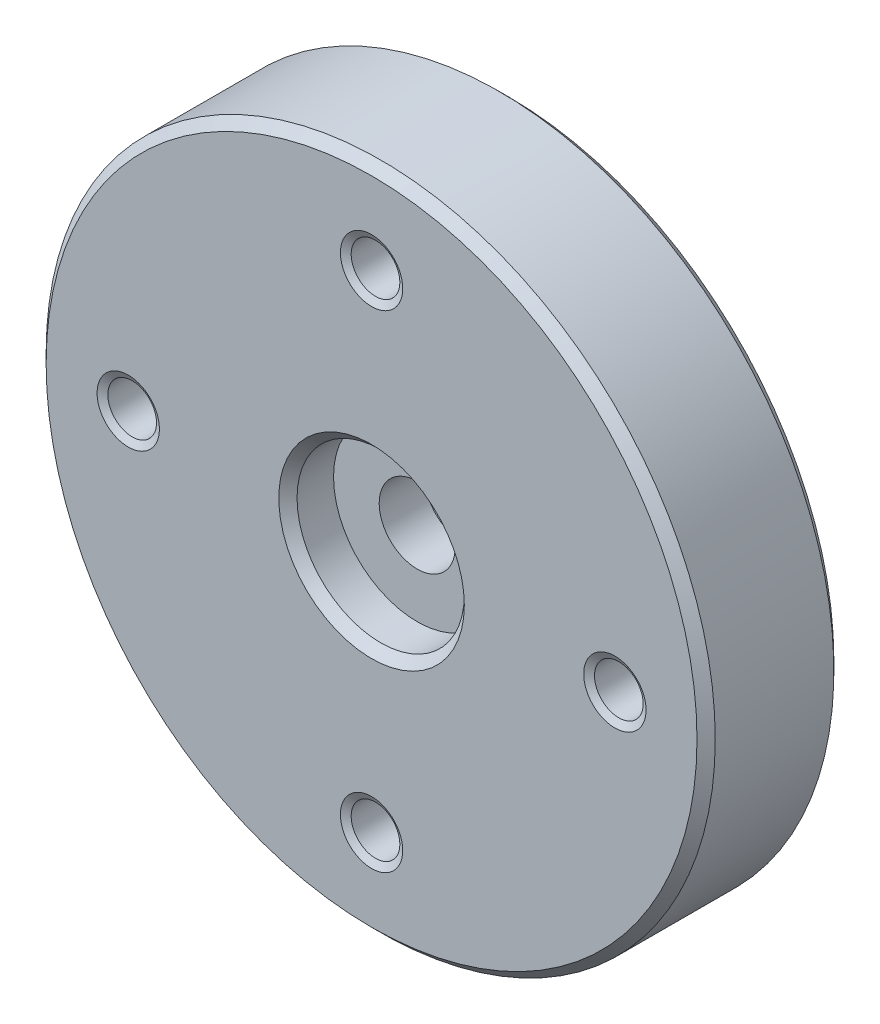
ISO-10303-21;
HEADER;
FILE_DESCRIPTION(('STEP AP214'),'2;1');
FILE_NAME('part.step','',(''),(''),'','','');
FILE_SCHEMA(('AUTOMOTIVE_DESIGN { 1 0 10303 214 1 1 1 1 }'));
ENDSEC;
DATA;
#1=APPLICATION_CONTEXT('core data for automotive mechanical design processes');
#2=APPLICATION_PROTOCOL_DEFINITION('international standard','automotive_design',2000,#1);
#3=PRODUCT_CONTEXT('',#1,'mechanical');
#4=PRODUCT('Part','Part','',(#3));
#5=PRODUCT_RELATED_PRODUCT_CATEGORY('part','',(#4));
#6=PRODUCT_DEFINITION_FORMATION('','',#4);
#7=PRODUCT_DEFINITION_CONTEXT('part definition',#1,'design');
#8=PRODUCT_DEFINITION('design','',#6,#7);
#9=PRODUCT_DEFINITION_SHAPE('','',#8);
#10=(LENGTH_UNIT() NAMED_UNIT(*) SI_UNIT(.MILLI.,.METRE.));
#11=(NAMED_UNIT(*) PLANE_ANGLE_UNIT() SI_UNIT($,.RADIAN.));
#12=(NAMED_UNIT(*) SI_UNIT($,.STERADIAN.) SOLID_ANGLE_UNIT());
#13=UNCERTAINTY_MEASURE_WITH_UNIT(LENGTH_MEASURE(1.E-05),#10,'distance_accuracy_value','');
#14=(GEOMETRIC_REPRESENTATION_CONTEXT(3) GLOBAL_UNCERTAINTY_ASSIGNED_CONTEXT((#13)) GLOBAL_UNIT_ASSIGNED_CONTEXT((#10,
#11,#12)) REPRESENTATION_CONTEXT('',''));
#15=CARTESIAN_POINT('',(0.,0.,0.));
#16=DIRECTION('',(0.,0.,1.));
#17=DIRECTION('',(1.,0.,0.));
#18=AXIS2_PLACEMENT_3D('',#15,#16,#17);
#19=CARTESIAN_POINT('',(0.,0.,0.));
#20=DIRECTION('',(0.,0.,-1.));
#21=DIRECTION('',(-1.,0.,0.));
#22=AXIS2_PLACEMENT_3D('',#19,#20,#21);
#23=CYLINDRICAL_SURFACE('',#22,2.75);
#24=CARTESIAN_POINT('',(0.,0.,-0.300000000000006));
#25=DIRECTION('',(0.,0.,1.));
#26=DIRECTION('',(1.,0.,0.));
#27=AXIS2_PLACEMENT_3D('',#24,#25,#26);
#28=CIRCLE('',#27,2.75);
#29=CARTESIAN_POINT('',(2.75,0.,-0.300000000000006));
#30=VERTEX_POINT('',#29);
#31=EDGE_CURVE('E75',#30,#30,#28,.T.);
#32=ORIENTED_EDGE('',*,*,#31,.T.);
#33=EDGE_LOOP('',(#32));
#34=FACE_BOUND('',#33,.T.);
#35=CARTESIAN_POINT('',(0.,0.,-1.5));
#36=DIRECTION('',(0.,0.,-1.));
#37=DIRECTION('',(-1.,0.,0.));
#38=AXIS2_PLACEMENT_3D('',#35,#36,#37);
#39=CIRCLE('',#38,2.75);
#40=CARTESIAN_POINT('',(-2.75,0.,-1.5));
#41=VERTEX_POINT('',#40);
#42=EDGE_CURVE('E107',#41,#41,#39,.T.);
#43=ORIENTED_EDGE('',*,*,#42,.T.);
#44=EDGE_LOOP('',(#43));
#45=FACE_BOUND('',#44,.T.);
#46=ADVANCED_FACE('F42',(#34,#45),#23,.F.);
#47=CARTESIAN_POINT('',(0.,2.75,0.));
#48=DIRECTION('',(0.,0.,1.));
#49=DIRECTION('',(1.,0.,0.));
#50=AXIS2_PLACEMENT_3D('',#47,#48,#49);
#51=PLANE('',#50);
#52=CARTESIAN_POINT('',(0.,0.,0.));
#53=DIRECTION('',(0.,0.,1.));
#54=DIRECTION('',(1.,0.,0.));
#55=AXIS2_PLACEMENT_3D('',#52,#53,#54);
#56=CIRCLE('',#55,3.05);
#57=CARTESIAN_POINT('',(3.05,0.,0.));
#58=VERTEX_POINT('',#57);
#59=EDGE_CURVE('E79',#58,#58,#56,.F.);
#60=ORIENTED_EDGE('',*,*,#59,.T.);
#61=EDGE_LOOP('',(#60));
#62=FACE_BOUND('',#61,.T.);
#63=CARTESIAN_POINT('',(0.,0.,0.));
#64=DIRECTION('',(0.,0.,1.));
#65=DIRECTION('',(1.,0.,0.));
#66=AXIS2_PLACEMENT_3D('',#63,#64,#65);
#67=CIRCLE('',#66,10.7);
#68=CARTESIAN_POINT('',(10.7,0.,0.));
#69=VERTEX_POINT('',#68);
#70=EDGE_CURVE('E83',#69,#69,#67,.T.);
#71=ORIENTED_EDGE('',*,*,#70,.T.);
#72=EDGE_LOOP('',(#71));
#73=FACE_BOUND('',#72,.T.);
#74=CARTESIAN_POINT('',(0.,8.,0.));
#75=DIRECTION('',(0.,0.,1.));
#76=DIRECTION('',(1.,0.,0.));
#77=AXIS2_PLACEMENT_3D('',#74,#75,#76);
#78=CIRCLE('',#77,1.025);
#79=CARTESIAN_POINT('',(1.025,8.,0.));
#80=VERTEX_POINT('',#79);
#81=EDGE_CURVE('E167',#80,#80,#78,.T.);
#82=ORIENTED_EDGE('',*,*,#81,.F.);
#83=EDGE_LOOP('',(#82));
#84=FACE_BOUND('',#83,.T.);
#85=CARTESIAN_POINT('',(8.,0.,0.));
#86=DIRECTION('',(0.,0.,1.));
#87=DIRECTION('',(1.,0.,0.));
#88=AXIS2_PLACEMENT_3D('',#85,#86,#87);
#89=CIRCLE('',#88,1.025);
#90=CARTESIAN_POINT('',(9.025,0.,0.));
#91=VERTEX_POINT('',#90);
#92=EDGE_CURVE('E151',#91,#91,#89,.T.);
#93=ORIENTED_EDGE('',*,*,#92,.F.);
#94=EDGE_LOOP('',(#93));
#95=FACE_BOUND('',#94,.T.);
#96=CARTESIAN_POINT('',(0.,-8.,0.));
#97=DIRECTION('',(0.,0.,1.));
#98=DIRECTION('',(1.,0.,0.));
#99=AXIS2_PLACEMENT_3D('',#96,#97,#98);
#100=CIRCLE('',#99,1.025);
#101=CARTESIAN_POINT('',(1.025,-8.,0.));
#102=VERTEX_POINT('',#101);
#103=EDGE_CURVE('E135',#102,#102,#100,.T.);
#104=ORIENTED_EDGE('',*,*,#103,.F.);
#105=EDGE_LOOP('',(#104));
#106=FACE_BOUND('',#105,.T.);
#107=CARTESIAN_POINT('',(-8.,0.,0.));
#108=DIRECTION('',(0.,0.,1.));
#109=DIRECTION('',(1.,0.,0.));
#110=AXIS2_PLACEMENT_3D('',#107,#108,#109);
#111=CIRCLE('',#110,1.025);
#112=CARTESIAN_POINT('',(-6.975,0.,0.));
#113=VERTEX_POINT('',#112);
#114=EDGE_CURVE('E119',#113,#113,#111,.T.);
#115=ORIENTED_EDGE('',*,*,#114,.F.);
#116=EDGE_LOOP('',(#115));
#117=FACE_BOUND('',#116,.T.);
#118=ADVANCED_FACE('F201',(#62,#73,#84,#95,#106,#117),#51,.T.);
#119=CARTESIAN_POINT('',(0.,0.,0.));
#120=DIRECTION('',(0.,0.,-1.));
#121=DIRECTION('',(-1.,0.,0.));
#122=AXIS2_PLACEMENT_3D('',#119,#120,#121);
#123=CYLINDRICAL_SURFACE('',#122,11.);
#124=CARTESIAN_POINT('',(0.,0.,-4.2));
#125=DIRECTION('',(0.,0.,-1.));
#126=DIRECTION('',(-1.,0.,0.));
#127=AXIS2_PLACEMENT_3D('',#124,#125,#126);
#128=CIRCLE('',#127,11.);
#129=CARTESIAN_POINT('',(-11.,0.,-4.2));
#130=VERTEX_POINT('',#129);
#131=EDGE_CURVE('E10',#130,#130,#128,.F.);
#132=ORIENTED_EDGE('',*,*,#131,.T.);
#133=EDGE_LOOP('',(#132));
#134=FACE_BOUND('',#133,.T.);
#135=CARTESIAN_POINT('',(0.,0.,-0.299999999999998));
#136=DIRECTION('',(0.,0.,1.));
#137=DIRECTION('',(1.,0.,0.));
#138=AXIS2_PLACEMENT_3D('',#135,#136,#137);
#139=CIRCLE('',#138,11.);
#140=CARTESIAN_POINT('',(11.,0.,-0.299999999999998));
#141=VERTEX_POINT('',#140);
#142=EDGE_CURVE('E50',#141,#141,#139,.F.);
#143=ORIENTED_EDGE('',*,*,#142,.T.);
#144=EDGE_LOOP('',(#143));
#145=FACE_BOUND('',#144,.T.);
#146=ADVANCED_FACE('F204',(#134,#145),#123,.T.);
#147=CARTESIAN_POINT('',(0.,11.,-4.5));
#148=DIRECTION('',(0.,0.,-1.));
#149=DIRECTION('',(-1.,0.,0.));
#150=AXIS2_PLACEMENT_3D('',#147,#148,#149);
#151=PLANE('',#150);
#152=CARTESIAN_POINT('',(0.,0.,-4.5));
#153=DIRECTION('',(0.,0.,-1.));
#154=DIRECTION('',(-1.,0.,0.));
#155=AXIS2_PLACEMENT_3D('',#152,#153,#154);
#156=CIRCLE('',#155,10.7);
#157=CARTESIAN_POINT('',(-10.7,0.,-4.5));
#158=VERTEX_POINT('',#157);
#159=EDGE_CURVE('E58',#158,#158,#156,.T.);
#160=ORIENTED_EDGE('',*,*,#159,.T.);
#161=EDGE_LOOP('',(#160));
#162=FACE_BOUND('',#161,.T.);
#163=CARTESIAN_POINT('',(0.,8.,-4.5));
#164=DIRECTION('',(0.,0.,1.));
#165=DIRECTION('',(1.,0.,0.));
#166=AXIS2_PLACEMENT_3D('',#163,#164,#165);
#167=CIRCLE('',#166,1.025);
#168=CARTESIAN_POINT('',(1.025,8.,-4.5));
#169=VERTEX_POINT('',#168);
#170=EDGE_CURVE('E171',#169,#169,#167,.T.);
#171=ORIENTED_EDGE('',*,*,#170,.T.);
#172=EDGE_LOOP('',(#171));
#173=FACE_BOUND('',#172,.T.);
#174=CARTESIAN_POINT('',(8.,0.,-4.5));
#175=DIRECTION('',(0.,0.,1.));
#176=DIRECTION('',(1.,0.,0.));
#177=AXIS2_PLACEMENT_3D('',#174,#175,#176);
#178=CIRCLE('',#177,1.025);
#179=CARTESIAN_POINT('',(9.025,0.,-4.5));
#180=VERTEX_POINT('',#179);
#181=EDGE_CURVE('E155',#180,#180,#178,.T.);
#182=ORIENTED_EDGE('',*,*,#181,.T.);
#183=EDGE_LOOP('',(#182));
#184=FACE_BOUND('',#183,.T.);
#185=CARTESIAN_POINT('',(0.,-8.,-4.5));
#186=DIRECTION('',(0.,0.,1.));
#187=DIRECTION('',(1.,0.,0.));
#188=AXIS2_PLACEMENT_3D('',#185,#186,#187);
#189=CIRCLE('',#188,1.025);
#190=CARTESIAN_POINT('',(1.025,-8.,-4.5));
#191=VERTEX_POINT('',#190);
#192=EDGE_CURVE('E139',#191,#191,#189,.T.);
#193=ORIENTED_EDGE('',*,*,#192,.T.);
#194=EDGE_LOOP('',(#193));
#195=FACE_BOUND('',#194,.T.);
#196=CARTESIAN_POINT('',(-8.,0.,-4.5));
#197=DIRECTION('',(0.,0.,1.));
#198=DIRECTION('',(1.,0.,0.));
#199=AXIS2_PLACEMENT_3D('',#196,#197,#198);
#200=CIRCLE('',#199,1.025);
#201=CARTESIAN_POINT('',(-6.975,0.,-4.5));
#202=VERTEX_POINT('',#201);
#203=EDGE_CURVE('E123',#202,#202,#200,.T.);
#204=ORIENTED_EDGE('',*,*,#203,.T.);
#205=EDGE_LOOP('',(#204));
#206=FACE_BOUND('',#205,.T.);
#207=CARTESIAN_POINT('',(0.,0.,-4.5));
#208=DIRECTION('',(0.,0.,-1.));
#209=DIRECTION('',(-1.,0.,0.));
#210=AXIS2_PLACEMENT_3D('',#207,#208,#209);
#211=CIRCLE('',#210,4.5);
#212=CARTESIAN_POINT('',(-4.5,0.,-4.5));
#213=VERTEX_POINT('',#212);
#214=EDGE_CURVE('E87',#213,#213,#211,.T.);
#215=ORIENTED_EDGE('',*,*,#214,.F.);
#216=EDGE_LOOP('',(#215));
#217=FACE_BOUND('',#216,.T.);
#218=ADVANCED_FACE('F178',(#162,#173,#184,#195,#206,#217),#151,.T.);
#219=CARTESIAN_POINT('',(0.,0.,0.));
#220=DIRECTION('',(0.,0.,-1.));
#221=DIRECTION('',(-1.,0.,0.));
#222=AXIS2_PLACEMENT_3D('',#219,#220,#221);
#223=CYLINDRICAL_SURFACE('',#222,4.5);
#224=CARTESIAN_POINT('',(0.,0.,-6.4));
#225=DIRECTION('',(0.,0.,-1.));
#226=DIRECTION('',(-1.,0.,0.));
#227=AXIS2_PLACEMENT_3D('',#224,#225,#226);
#228=CIRCLE('',#227,4.5);
#229=CARTESIAN_POINT('',(-4.5,0.,-6.4));
#230=VERTEX_POINT('',#229);
#231=EDGE_CURVE('E65',#230,#230,#228,.F.);
#232=ORIENTED_EDGE('',*,*,#231,.T.);
#233=EDGE_LOOP('',(#232));
#234=FACE_BOUND('',#233,.T.);
#235=ORIENTED_EDGE('',*,*,#214,.T.);
#236=EDGE_LOOP('',(#235));
#237=FACE_BOUND('',#236,.T.);
#238=ADVANCED_FACE('F254',(#234,#237),#223,.T.);
#239=CARTESIAN_POINT('',(0.,4.5,-6.7));
#240=DIRECTION('',(0.,0.,-1.));
#241=DIRECTION('',(-1.,0.,0.));
#242=AXIS2_PLACEMENT_3D('',#239,#240,#241);
#243=PLANE('',#242);
#244=CARTESIAN_POINT('',(0.,0.,-6.7));
#245=DIRECTION('',(0.,0.,-1.));
#246=DIRECTION('',(-1.,0.,0.));
#247=AXIS2_PLACEMENT_3D('',#244,#245,#246);
#248=CIRCLE('',#247,4.2);
#249=CARTESIAN_POINT('',(-4.2,0.,-6.7));
#250=VERTEX_POINT('',#249);
#251=EDGE_CURVE('E71',#250,#250,#248,.T.);
#252=ORIENTED_EDGE('',*,*,#251,.T.);
#253=EDGE_LOOP('',(#252));
#254=FACE_BOUND('',#253,.T.);
#255=CARTESIAN_POINT('',(0.,0.,-6.7));
#256=DIRECTION('',(0.,0.,-1.));
#257=DIRECTION('',(-1.,0.,0.));
#258=AXIS2_PLACEMENT_3D('',#255,#256,#257);
#259=CIRCLE('',#258,2.75);
#260=CARTESIAN_POINT('',(-2.75,0.,-6.7));
#261=VERTEX_POINT('',#260);
#262=EDGE_CURVE('E91',#261,#261,#259,.T.);
#263=ORIENTED_EDGE('',*,*,#262,.F.);
#264=EDGE_LOOP('',(#263));
#265=FACE_BOUND('',#264,.T.);
#266=ADVANCED_FACE('F260',(#254,#265),#243,.T.);
#267=CARTESIAN_POINT('',(0.,0.,0.));
#268=DIRECTION('',(0.,0.,-1.));
#269=DIRECTION('',(-1.,0.,0.));
#270=AXIS2_PLACEMENT_3D('',#267,#268,#269);
#271=CYLINDRICAL_SURFACE('',#270,2.75);
#272=ORIENTED_EDGE('',*,*,#262,.T.);
#273=EDGE_LOOP('',(#272));
#274=FACE_BOUND('',#273,.T.);
#275=CARTESIAN_POINT('',(0.,0.,-3.));
#276=DIRECTION('',(0.,0.,-1.));
#277=DIRECTION('',(-1.,0.,0.));
#278=AXIS2_PLACEMENT_3D('',#275,#276,#277);
#279=CIRCLE('',#278,2.75);
#280=CARTESIAN_POINT('',(-2.75,0.,-3.));
#281=VERTEX_POINT('',#280);
#282=EDGE_CURVE('E95',#281,#281,#279,.T.);
#283=ORIENTED_EDGE('',*,*,#282,.F.);
#284=EDGE_LOOP('',(#283));
#285=FACE_BOUND('',#284,.T.);
#286=ADVANCED_FACE('F266',(#274,#285),#271,.F.);
#287=CARTESIAN_POINT('',(0.,2.75,-3.));
#288=DIRECTION('',(0.,0.,-1.));
#289=DIRECTION('',(-1.,0.,0.));
#290=AXIS2_PLACEMENT_3D('',#287,#288,#289);
#291=PLANE('',#290);
#292=ORIENTED_EDGE('',*,*,#282,.T.);
#293=EDGE_LOOP('',(#292));
#294=FACE_BOUND('',#293,.T.);
#295=CARTESIAN_POINT('',(0.,0.,-3.));
#296=DIRECTION('',(0.,0.,-1.));
#297=DIRECTION('',(-1.,0.,0.));
#298=AXIS2_PLACEMENT_3D('',#295,#296,#297);
#299=CIRCLE('',#298,1.25);
#300=CARTESIAN_POINT('',(-1.25,0.,-3.));
#301=VERTEX_POINT('',#300);
#302=EDGE_CURVE('E99',#301,#301,#299,.T.);
#303=ORIENTED_EDGE('',*,*,#302,.F.);
#304=EDGE_LOOP('',(#303));
#305=FACE_BOUND('',#304,.T.);
#306=ADVANCED_FACE('F270',(#294,#305),#291,.T.);
#307=CARTESIAN_POINT('',(0.,0.,0.));
#308=DIRECTION('',(0.,0.,-1.));
#309=DIRECTION('',(-1.,0.,0.));
#310=AXIS2_PLACEMENT_3D('',#307,#308,#309);
#311=CYLINDRICAL_SURFACE('',#310,1.25);
#312=ORIENTED_EDGE('',*,*,#302,.T.);
#313=EDGE_LOOP('',(#312));
#314=FACE_BOUND('',#313,.T.);
#315=CARTESIAN_POINT('',(0.,0.,-1.5));
#316=DIRECTION('',(0.,0.,-1.));
#317=DIRECTION('',(-1.,0.,0.));
#318=AXIS2_PLACEMENT_3D('',#315,#316,#317);
#319=CIRCLE('',#318,1.25);
#320=CARTESIAN_POINT('',(-1.25,0.,-1.5));
#321=VERTEX_POINT('',#320);
#322=EDGE_CURVE('E103',#321,#321,#319,.T.);
#323=ORIENTED_EDGE('',*,*,#322,.F.);
#324=EDGE_LOOP('',(#323));
#325=FACE_BOUND('',#324,.T.);
#326=ADVANCED_FACE('F274',(#314,#325),#311,.F.);
#327=CARTESIAN_POINT('',(0.,2.75,-1.5));
#328=DIRECTION('',(0.,0.,1.));
#329=DIRECTION('',(1.,0.,0.));
#330=AXIS2_PLACEMENT_3D('',#327,#328,#329);
#331=PLANE('',#330);
#332=ORIENTED_EDGE('',*,*,#322,.T.);
#333=EDGE_LOOP('',(#332));
#334=FACE_BOUND('',#333,.T.);
#335=ORIENTED_EDGE('',*,*,#42,.F.);
#336=EDGE_LOOP('',(#335));
#337=FACE_BOUND('',#336,.T.);
#338=ADVANCED_FACE('F278',(#334,#337),#331,.T.);
#339=CARTESIAN_POINT('',(-8.,0.,-4.37009618943233));
#340=DIRECTION('',(0.,0.,-1.));
#341=DIRECTION('',(-1.,0.,0.));
#342=AXIS2_PLACEMENT_3D('',#339,#340,#341);
#343=CONICAL_SURFACE('',#342,0.799999999999999,1.0471975511966);
#344=ORIENTED_EDGE('',*,*,#203,.F.);
#345=EDGE_LOOP('',(#344));
#346=FACE_BOUND('',#345,.T.);
#347=CARTESIAN_POINT('',(-8.,0.,-4.37009618943233));
#348=DIRECTION('',(0.,0.,1.));
#349=DIRECTION('',(1.,0.,0.));
#350=AXIS2_PLACEMENT_3D('',#347,#348,#349);
#351=CIRCLE('',#350,0.799999999999999);
#352=CARTESIAN_POINT('',(-7.2,0.,-4.37009618943233));
#353=VERTEX_POINT('',#352);
#354=EDGE_CURVE('E111',#353,#353,#351,.T.);
#355=ORIENTED_EDGE('',*,*,#354,.T.);
#356=EDGE_LOOP('',(#355));
#357=FACE_BOUND('',#356,.T.);
#358=ADVANCED_FACE('F226',(#346,#357),#343,.F.);
#359=CARTESIAN_POINT('',(-8.,0.,0.));
#360=DIRECTION('',(0.,0.,1.));
#361=DIRECTION('',(1.,0.,0.));
#362=AXIS2_PLACEMENT_3D('',#359,#360,#361);
#363=CYLINDRICAL_SURFACE('',#362,0.799999999999999);
#364=ORIENTED_EDGE('',*,*,#354,.F.);
#365=EDGE_LOOP('',(#364));
#366=FACE_BOUND('',#365,.T.);
#367=CARTESIAN_POINT('',(-8.,0.,-0.129903810567662));
#368=DIRECTION('',(0.,0.,1.));
#369=DIRECTION('',(1.,0.,0.));
#370=AXIS2_PLACEMENT_3D('',#367,#368,#369);
#371=CIRCLE('',#370,0.8);
#372=CARTESIAN_POINT('',(-7.2,0.,-0.129903810567662));
#373=VERTEX_POINT('',#372);
#374=EDGE_CURVE('E115',#373,#373,#371,.T.);
#375=ORIENTED_EDGE('',*,*,#374,.T.);
#376=EDGE_LOOP('',(#375));
#377=FACE_BOUND('',#376,.T.);
#378=ADVANCED_FACE('F216',(#366,#377),#363,.F.);
#379=CARTESIAN_POINT('',(-8.,0.,0.));
#380=DIRECTION('',(0.,0.,1.));
#381=DIRECTION('',(1.,0.,0.));
#382=AXIS2_PLACEMENT_3D('',#379,#380,#381);
#383=CONICAL_SURFACE('',#382,1.025,1.0471975511966);
#384=ORIENTED_EDGE('',*,*,#374,.F.);
#385=EDGE_LOOP('',(#384));
#386=FACE_BOUND('',#385,.T.);
#387=ORIENTED_EDGE('',*,*,#114,.T.);
#388=EDGE_LOOP('',(#387));
#389=FACE_BOUND('',#388,.T.);
#390=ADVANCED_FACE('F213',(#386,#389),#383,.F.);
#391=CARTESIAN_POINT('',(0.,-8.,-4.37009618943233));
#392=DIRECTION('',(0.,0.,-1.));
#393=DIRECTION('',(-1.,0.,0.));
#394=AXIS2_PLACEMENT_3D('',#391,#392,#393);
#395=CONICAL_SURFACE('',#394,0.799999999999999,1.0471975511966);
#396=ORIENTED_EDGE('',*,*,#192,.F.);
#397=EDGE_LOOP('',(#396));
#398=FACE_BOUND('',#397,.T.);
#399=CARTESIAN_POINT('',(0.,-8.,-4.37009618943233));
#400=DIRECTION('',(0.,0.,1.));
#401=DIRECTION('',(1.,0.,0.));
#402=AXIS2_PLACEMENT_3D('',#399,#400,#401);
#403=CIRCLE('',#402,0.799999999999999);
#404=CARTESIAN_POINT('',(0.799999999999999,-8.,-4.37009618943233));
#405=VERTEX_POINT('',#404);
#406=EDGE_CURVE('E127',#405,#405,#403,.T.);
#407=ORIENTED_EDGE('',*,*,#406,.T.);
#408=EDGE_LOOP('',(#407));
#409=FACE_BOUND('',#408,.T.);
#410=ADVANCED_FACE('F215',(#398,#409),#395,.F.);
#411=CARTESIAN_POINT('',(0.,-8.,0.));
#412=DIRECTION('',(0.,0.,1.));
#413=DIRECTION('',(1.,0.,0.));
#414=AXIS2_PLACEMENT_3D('',#411,#412,#413);
#415=CYLINDRICAL_SURFACE('',#414,0.799999999999999);
#416=ORIENTED_EDGE('',*,*,#406,.F.);
#417=EDGE_LOOP('',(#416));
#418=FACE_BOUND('',#417,.T.);
#419=CARTESIAN_POINT('',(0.,-8.,-0.129903810567662));
#420=DIRECTION('',(0.,0.,1.));
#421=DIRECTION('',(1.,0.,0.));
#422=AXIS2_PLACEMENT_3D('',#419,#420,#421);
#423=CIRCLE('',#422,0.8);
#424=CARTESIAN_POINT('',(0.8,-8.,-0.129903810567662));
#425=VERTEX_POINT('',#424);
#426=EDGE_CURVE('E131',#425,#425,#423,.T.);
#427=ORIENTED_EDGE('',*,*,#426,.T.);
#428=EDGE_LOOP('',(#427));
#429=FACE_BOUND('',#428,.T.);
#430=ADVANCED_FACE('F223',(#418,#429),#415,.F.);
#431=CARTESIAN_POINT('',(0.,-8.,0.));
#432=DIRECTION('',(0.,0.,1.));
#433=DIRECTION('',(1.,0.,0.));
#434=AXIS2_PLACEMENT_3D('',#431,#432,#433);
#435=CONICAL_SURFACE('',#434,1.025,1.0471975511966);
#436=ORIENTED_EDGE('',*,*,#426,.F.);
#437=EDGE_LOOP('',(#436));
#438=FACE_BOUND('',#437,.T.);
#439=ORIENTED_EDGE('',*,*,#103,.T.);
#440=EDGE_LOOP('',(#439));
#441=FACE_BOUND('',#440,.T.);
#442=ADVANCED_FACE('F317',(#438,#441),#435,.F.);
#443=CARTESIAN_POINT('',(8.,0.,-4.37009618943233));
#444=DIRECTION('',(0.,0.,-1.));
#445=DIRECTION('',(-1.,0.,0.));
#446=AXIS2_PLACEMENT_3D('',#443,#444,#445);
#447=CONICAL_SURFACE('',#446,0.799999999999999,1.04719755119659);
#448=ORIENTED_EDGE('',*,*,#181,.F.);
#449=EDGE_LOOP('',(#448));
#450=FACE_BOUND('',#449,.T.);
#451=CARTESIAN_POINT('',(8.,0.,-4.37009618943233));
#452=DIRECTION('',(0.,0.,1.));
#453=DIRECTION('',(1.,0.,0.));
#454=AXIS2_PLACEMENT_3D('',#451,#452,#453);
#455=CIRCLE('',#454,0.799999999999999);
#456=CARTESIAN_POINT('',(8.8,0.,-4.37009618943233));
#457=VERTEX_POINT('',#456);
#458=EDGE_CURVE('E143',#457,#457,#455,.T.);
#459=ORIENTED_EDGE('',*,*,#458,.T.);
#460=EDGE_LOOP('',(#459));
#461=FACE_BOUND('',#460,.T.);
#462=ADVANCED_FACE('F326',(#450,#461),#447,.F.);
#463=CARTESIAN_POINT('',(8.,0.,0.));
#464=DIRECTION('',(0.,0.,1.));
#465=DIRECTION('',(1.,0.,0.));
#466=AXIS2_PLACEMENT_3D('',#463,#464,#465);
#467=CYLINDRICAL_SURFACE('',#466,0.799999999999999);
#468=ORIENTED_EDGE('',*,*,#458,.F.);
#469=EDGE_LOOP('',(#468));
#470=FACE_BOUND('',#469,.T.);
#471=CARTESIAN_POINT('',(8.,0.,-0.129903810567662));
#472=DIRECTION('',(0.,0.,1.));
#473=DIRECTION('',(1.,0.,0.));
#474=AXIS2_PLACEMENT_3D('',#471,#472,#473);
#475=CIRCLE('',#474,0.8);
#476=CARTESIAN_POINT('',(8.8,0.,-0.129903810567662));
#477=VERTEX_POINT('',#476);
#478=EDGE_CURVE('E147',#477,#477,#475,.T.);
#479=ORIENTED_EDGE('',*,*,#478,.T.);
#480=EDGE_LOOP('',(#479));
#481=FACE_BOUND('',#480,.T.);
#482=ADVANCED_FACE('F335',(#470,#481),#467,.F.);
#483=CARTESIAN_POINT('',(8.,0.,0.));
#484=DIRECTION('',(0.,0.,1.));
#485=DIRECTION('',(1.,0.,0.));
#486=AXIS2_PLACEMENT_3D('',#483,#484,#485);
#487=CONICAL_SURFACE('',#486,1.025,1.0471975511966);
#488=ORIENTED_EDGE('',*,*,#478,.F.);
#489=EDGE_LOOP('',(#488));
#490=FACE_BOUND('',#489,.T.);
#491=ORIENTED_EDGE('',*,*,#92,.T.);
#492=EDGE_LOOP('',(#491));
#493=FACE_BOUND('',#492,.T.);
#494=ADVANCED_FACE('F185',(#490,#493),#487,.F.);
#495=CARTESIAN_POINT('',(0.,8.,-4.37009618943233));
#496=DIRECTION('',(0.,0.,-1.));
#497=DIRECTION('',(-1.,0.,0.));
#498=AXIS2_PLACEMENT_3D('',#495,#496,#497);
#499=CONICAL_SURFACE('',#498,0.799999999999999,1.0471975511966);
#500=ORIENTED_EDGE('',*,*,#170,.F.);
#501=EDGE_LOOP('',(#500));
#502=FACE_BOUND('',#501,.T.);
#503=CARTESIAN_POINT('',(0.,8.,-4.37009618943233));
#504=DIRECTION('',(0.,0.,1.));
#505=DIRECTION('',(1.,0.,0.));
#506=AXIS2_PLACEMENT_3D('',#503,#504,#505);
#507=CIRCLE('',#506,0.799999999999999);
#508=CARTESIAN_POINT('',(0.799999999999999,8.,-4.37009618943233));
#509=VERTEX_POINT('',#508);
#510=EDGE_CURVE('E159',#509,#509,#507,.T.);
#511=ORIENTED_EDGE('',*,*,#510,.T.);
#512=EDGE_LOOP('',(#511));
#513=FACE_BOUND('',#512,.T.);
#514=ADVANCED_FACE('F181',(#502,#513),#499,.F.);
#515=CARTESIAN_POINT('',(0.,8.,0.));
#516=DIRECTION('',(0.,0.,1.));
#517=DIRECTION('',(1.,0.,0.));
#518=AXIS2_PLACEMENT_3D('',#515,#516,#517);
#519=CYLINDRICAL_SURFACE('',#518,0.799999999999999);
#520=ORIENTED_EDGE('',*,*,#510,.F.);
#521=EDGE_LOOP('',(#520));
#522=FACE_BOUND('',#521,.T.);
#523=CARTESIAN_POINT('',(0.,8.,-0.129903810567662));
#524=DIRECTION('',(0.,0.,1.));
#525=DIRECTION('',(1.,0.,0.));
#526=AXIS2_PLACEMENT_3D('',#523,#524,#525);
#527=CIRCLE('',#526,0.8);
#528=CARTESIAN_POINT('',(0.8,8.,-0.129903810567662));
#529=VERTEX_POINT('',#528);
#530=EDGE_CURVE('E163',#529,#529,#527,.T.);
#531=ORIENTED_EDGE('',*,*,#530,.T.);
#532=EDGE_LOOP('',(#531));
#533=FACE_BOUND('',#532,.T.);
#534=ADVANCED_FACE('F184',(#522,#533),#519,.F.);
#535=CARTESIAN_POINT('',(0.,8.,0.));
#536=DIRECTION('',(0.,0.,1.));
#537=DIRECTION('',(1.,0.,0.));
#538=AXIS2_PLACEMENT_3D('',#535,#536,#537);
#539=CONICAL_SURFACE('',#538,1.025,1.0471975511966);
#540=ORIENTED_EDGE('',*,*,#530,.F.);
#541=EDGE_LOOP('',(#540));
#542=FACE_BOUND('',#541,.T.);
#543=ORIENTED_EDGE('',*,*,#81,.T.);
#544=EDGE_LOOP('',(#543));
#545=FACE_BOUND('',#544,.T.);
#546=ADVANCED_FACE('F191',(#542,#545),#539,.F.);
#547=CARTESIAN_POINT('',(0.,0.,0.));
#548=DIRECTION('',(0.,0.,1.));
#549=DIRECTION('',(1.,0.,0.));
#550=AXIS2_PLACEMENT_3D('',#547,#548,#549);
#551=CONICAL_SURFACE('',#550,3.05,0.78539816339744);
#552=ORIENTED_EDGE('',*,*,#31,.F.);
#553=EDGE_LOOP('',(#552));
#554=FACE_BOUND('',#553,.T.);
#555=ORIENTED_EDGE('',*,*,#59,.F.);
#556=EDGE_LOOP('',(#555));
#557=FACE_BOUND('',#556,.T.);
#558=ADVANCED_FACE('F197',(#554,#557),#551,.F.);
#559=CARTESIAN_POINT('',(0.,0.,-6.7));
#560=DIRECTION('',(0.,0.,1.));
#561=DIRECTION('',(1.,0.,0.));
#562=AXIS2_PLACEMENT_3D('',#559,#560,#561);
#563=CONICAL_SURFACE('',#562,4.2,0.785398163397445);
#564=ORIENTED_EDGE('',*,*,#231,.F.);
#565=EDGE_LOOP('',(#564));
#566=FACE_BOUND('',#565,.T.);
#567=ORIENTED_EDGE('',*,*,#251,.F.);
#568=EDGE_LOOP('',(#567));
#569=FACE_BOUND('',#568,.T.);
#570=ADVANCED_FACE('F239',(#566,#569),#563,.T.);
#571=CARTESIAN_POINT('',(0.,0.,-4.5));
#572=DIRECTION('',(0.,0.,1.));
#573=DIRECTION('',(1.,0.,0.));
#574=AXIS2_PLACEMENT_3D('',#571,#572,#573);
#575=CONICAL_SURFACE('',#574,10.7,0.785398163397451);
#576=ORIENTED_EDGE('',*,*,#131,.F.);
#577=EDGE_LOOP('',(#576));
#578=FACE_BOUND('',#577,.T.);
#579=ORIENTED_EDGE('',*,*,#159,.F.);
#580=EDGE_LOOP('',(#579));
#581=FACE_BOUND('',#580,.T.);
#582=ADVANCED_FACE('F242',(#578,#581),#575,.T.);
#583=CARTESIAN_POINT('',(0.,0.,-0.299999999999998));
#584=DIRECTION('',(0.,0.,-1.));
#585=DIRECTION('',(-1.,0.,0.));
#586=AXIS2_PLACEMENT_3D('',#583,#584,#585);
#587=CONICAL_SURFACE('',#586,11.,0.785398163397451);
#588=ORIENTED_EDGE('',*,*,#70,.F.);
#589=EDGE_LOOP('',(#588));
#590=FACE_BOUND('',#589,.T.);
#591=ORIENTED_EDGE('',*,*,#142,.F.);
#592=EDGE_LOOP('',(#591));
#593=FACE_BOUND('',#592,.T.);
#594=ADVANCED_FACE('F44',(#590,#593),#587,.T.);
#595=CLOSED_SHELL('',(#46,#118,#146,#218,#238,#266,#286,#306,#326,#338,#358,#378,#390,#410,#430,
#442,#462,#482,#494,#514,#534,#546,#558,#570,#582,#594));
#596=MANIFOLD_SOLID_BREP('B2',#595);
#597=ADVANCED_BREP_SHAPE_REPRESENTATION('',(#18,#596),#14);
#598=SHAPE_DEFINITION_REPRESENTATION(#9,#597);
ENDSEC;
END-ISO-10303-21;
